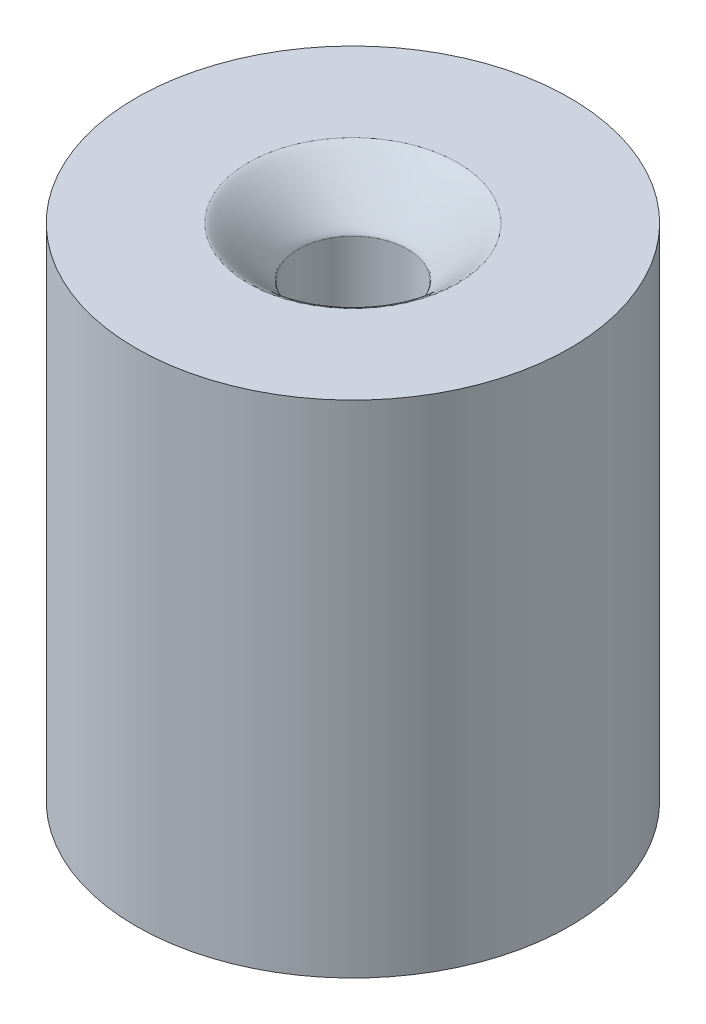
ISO-10303-21;
HEADER;
FILE_DESCRIPTION(('STEP AP214'),'2;1');
FILE_NAME('part.step','',(''),(''),'','','');
FILE_SCHEMA(('AUTOMOTIVE_DESIGN { 1 0 10303 214 1 1 1 1 }'));
ENDSEC;
DATA;
#1=APPLICATION_CONTEXT('core data for automotive mechanical design processes');
#2=APPLICATION_PROTOCOL_DEFINITION('international standard','automotive_design',2000,#1);
#3=PRODUCT_CONTEXT('',#1,'mechanical');
#4=PRODUCT('Part','Part','',(#3));
#5=PRODUCT_RELATED_PRODUCT_CATEGORY('part','',(#4));
#6=PRODUCT_DEFINITION_FORMATION('','',#4);
#7=PRODUCT_DEFINITION_CONTEXT('part definition',#1,'design');
#8=PRODUCT_DEFINITION('design','',#6,#7);
#9=PRODUCT_DEFINITION_SHAPE('','',#8);
#10=(LENGTH_UNIT() NAMED_UNIT(*) SI_UNIT(.MILLI.,.METRE.));
#11=(NAMED_UNIT(*) PLANE_ANGLE_UNIT() SI_UNIT($,.RADIAN.));
#12=(NAMED_UNIT(*) SI_UNIT($,.STERADIAN.) SOLID_ANGLE_UNIT());
#13=UNCERTAINTY_MEASURE_WITH_UNIT(LENGTH_MEASURE(1.E-05),#10,'distance_accuracy_value','');
#14=(GEOMETRIC_REPRESENTATION_CONTEXT(3) GLOBAL_UNCERTAINTY_ASSIGNED_CONTEXT((#13)) GLOBAL_UNIT_ASSIGNED_CONTEXT((#10,
#11,#12)) REPRESENTATION_CONTEXT('',''));
#15=CARTESIAN_POINT('',(0.,0.,0.));
#16=DIRECTION('',(0.,0.,1.));
#17=DIRECTION('',(1.,0.,0.));
#18=AXIS2_PLACEMENT_3D('',#15,#16,#17);
#19=CARTESIAN_POINT('',(0.,15.,0.));
#20=DIRECTION('',(0.,-1.,0.));
#21=DIRECTION('',(0.,0.,-1.));
#22=AXIS2_PLACEMENT_3D('',#19,#20,#21);
#23=CYLINDRICAL_SURFACE('',#22,6.5);
#24=CARTESIAN_POINT('',(0.,15.,0.));
#25=DIRECTION('',(0.,1.,0.));
#26=DIRECTION('',(0.,0.,1.));
#27=AXIS2_PLACEMENT_3D('',#24,#25,#26);
#28=CIRCLE('',#27,6.5);
#29=CARTESIAN_POINT('',(0.,15.,6.5));
#30=VERTEX_POINT('',#29);
#31=EDGE_CURVE('E62',#30,#30,#28,.T.);
#32=ORIENTED_EDGE('',*,*,#31,.F.);
#33=EDGE_LOOP('',(#32));
#34=FACE_BOUND('',#33,.T.);
#35=CARTESIAN_POINT('',(0.,0.,0.));
#36=DIRECTION('',(0.,1.,0.));
#37=DIRECTION('',(0.,0.,1.));
#38=AXIS2_PLACEMENT_3D('',#35,#36,#37);
#39=CIRCLE('',#38,6.5);
#40=CARTESIAN_POINT('',(0.,0.,6.5));
#41=VERTEX_POINT('',#40);
#42=EDGE_CURVE('E68',#41,#41,#39,.T.);
#43=ORIENTED_EDGE('',*,*,#42,.T.);
#44=EDGE_LOOP('',(#43));
#45=FACE_BOUND('',#44,.T.);
#46=ADVANCED_FACE('F42',(#34,#45),#23,.T.);
#47=CARTESIAN_POINT('',(0.,15.,0.));
#48=DIRECTION('',(0.,1.,0.));
#49=DIRECTION('',(0.,0.,1.));
#50=AXIS2_PLACEMENT_3D('',#47,#48,#49);
#51=PLANE('',#50);
#52=CARTESIAN_POINT('',(0.,15.,3.1383));
#53=CARTESIAN_POINT('',(0.410802502413288,15.,3.1383));
#54=CARTESIAN_POINT('',(0.821443391907262,15.,3.05661844852785));
#55=CARTESIAN_POINT('',(1.58050743967546,15.,2.74220382523249));
#56=CARTESIAN_POINT('',(1.92863197621287,15.,2.50959444658261));
#57=CARTESIAN_POINT('',(2.50959444658261,15.,1.92863197621287));
#58=CARTESIAN_POINT('',(2.74220382523247,15.,1.58050743967544));
#59=CARTESIAN_POINT('',(3.05661844852788,15.,0.821443391907283));
#60=CARTESIAN_POINT('',(3.1383,15.,0.410802502413305));
#61=CARTESIAN_POINT('',(3.1383,15.,-0.410802502413305));
#62=CARTESIAN_POINT('',(3.05661844852788,15.,-0.82144339190733));
#63=CARTESIAN_POINT('',(2.74220382523246,15.,-1.58050743967539));
#64=CARTESIAN_POINT('',(2.50959444658259,15.,-1.9286319762129));
#65=CARTESIAN_POINT('',(1.92863197621289,15.,-2.50959444658259));
#66=CARTESIAN_POINT('',(1.58050743967545,15.,-2.74220382523248));
#67=CARTESIAN_POINT('',(0.821443391907286,15.,-3.05661844852785));
#68=CARTESIAN_POINT('',(0.410802502413305,15.,-3.1383));
#69=CARTESIAN_POINT('',(-0.410802502413305,15.,-3.1383));
#70=CARTESIAN_POINT('',(-0.821443391907278,15.,-3.05661844852786));
#71=CARTESIAN_POINT('',(-1.58050743967544,15.,-2.74220382523249));
#72=CARTESIAN_POINT('',(-1.9286319762129,15.,-2.50959444658259));
#73=CARTESIAN_POINT('',(-2.50959444658259,15.,-1.9286319762129));
#74=CARTESIAN_POINT('',(-2.74220382523253,15.,-1.58050743967548));
#75=CARTESIAN_POINT('',(-3.05661844852781,15.,-0.821443391907247));
#76=CARTESIAN_POINT('',(-3.1383,15.,-0.4108025024133));
#77=CARTESIAN_POINT('',(-3.1383,15.,0.41080250241331));
#78=CARTESIAN_POINT('',(-3.05661844852781,15.,0.821443391907283));
#79=CARTESIAN_POINT('',(-2.74220382523254,15.,1.58050743967543));
#80=CARTESIAN_POINT('',(-2.50959444658255,15.,1.92863197621284));
#81=CARTESIAN_POINT('',(-1.92863197621294,15.,2.50959444658263));
#82=CARTESIAN_POINT('',(-1.58050743967548,15.,2.74220382523244));
#83=CARTESIAN_POINT('',(-0.821443391907247,15.,3.0566184485279));
#84=CARTESIAN_POINT('',(-0.410802502413289,15.,3.1383));
#85=CARTESIAN_POINT('',(0.,15.,3.1383));
#86=(BOUNDED_CURVE() B_SPLINE_CURVE(3,(#52,#53,#54,#55,#56,#57,#58,#59,#60,#61,#62,#63,#64,#65,
#66,#67,#68,#69,#70,#71,#72,#73,#74,#75,#76,#77,#78,#79,#80,#81,#82,#83,#84,#85),.UNSPECIFIED.,
.T.,.F.) B_SPLINE_CURVE_WITH_KNOTS((4,2,2,2,2,2,2,2,2,2,2,2,2,2,2,2,4),(0.,0.392699081698724,
0.785398163397448,1.17809724509617,1.5707963267949,1.96349540849362,2.35619449019234,
2.74889357189107,3.14159265358979,3.53429173528852,3.92699081698724,4.31968989868597,
4.71238898038469,5.10508806208341,5.49778714378214,5.89048622548086,6.28318530717959),
.UNSPECIFIED.) CURVE() GEOMETRIC_REPRESENTATION_ITEM() RATIONAL_B_SPLINE_CURVE((1.,1.,1.,1.,1.,
1.,1.,1.,1.,1.,1.,1.,1.,1.,1.,1.,1.,1.,1.,1.,1.,1.,1.,1.,1.,1.,1.,1.,1.,1.,1.,1.,1.,1.)) REPRESENTATION_ITEM(''));
#87=CARTESIAN_POINT('',(0.,15.,3.1383));
#88=VERTEX_POINT('',#87);
#89=EDGE_CURVE('E11',#88,#88,#86,.F.);
#90=ORIENTED_EDGE('',*,*,#89,.T.);
#91=EDGE_LOOP('',(#90));
#92=FACE_BOUND('',#91,.T.);
#93=ORIENTED_EDGE('',*,*,#31,.T.);
#94=EDGE_LOOP('',(#93));
#95=FACE_BOUND('',#94,.T.);
#96=ADVANCED_FACE('F92',(#92,#95),#51,.T.);
#97=CARTESIAN_POINT('',(0.,0.,0.));
#98=DIRECTION('',(0.,1.,0.));
#99=DIRECTION('',(0.,0.,1.));
#100=AXIS2_PLACEMENT_3D('',#97,#98,#99);
#101=PLANE('',#100);
#102=CARTESIAN_POINT('',(0.,0.,0.));
#103=DIRECTION('',(0.,1.,0.));
#104=DIRECTION('',(0.,0.,1.));
#105=AXIS2_PLACEMENT_3D('',#102,#103,#104);
#106=CIRCLE('',#105,1.6383);
#107=CARTESIAN_POINT('',(0.,0.,1.6383));
#108=VERTEX_POINT('',#107);
#109=EDGE_CURVE('E74',#108,#108,#106,.T.);
#110=ORIENTED_EDGE('',*,*,#109,.T.);
#111=EDGE_LOOP('',(#110));
#112=FACE_BOUND('',#111,.T.);
#113=ORIENTED_EDGE('',*,*,#42,.F.);
#114=EDGE_LOOP('',(#113));
#115=FACE_BOUND('',#114,.T.);
#116=ADVANCED_FACE('F91',(#112,#115),#101,.F.);
#117=CARTESIAN_POINT('',(0.,0.,0.));
#118=DIRECTION('',(0.,1.,0.));
#119=DIRECTION('',(0.,0.,1.));
#120=AXIS2_PLACEMENT_3D('',#117,#118,#119);
#121=CYLINDRICAL_SURFACE('',#120,1.6383);
#122=CARTESIAN_POINT('',(0.,13.5,1.6383));
#123=CARTESIAN_POINT('',(-0.214452964886624,13.5,1.6383));
#124=CARTESIAN_POINT('',(-0.428821562298608,13.5,1.59565943479693));
#125=CARTESIAN_POINT('',(-0.825078972188849,13.5,1.43152424142955));
#126=CARTESIAN_POINT('',(-1.00681189390103,13.5,1.31009418533481));
#127=CARTESIAN_POINT('',(-1.31009418533482,13.5,1.00681189390102));
#128=CARTESIAN_POINT('',(-1.43152424142956,13.5,0.825078972188829));
#129=CARTESIAN_POINT('',(-1.59565943479692,13.5,0.428821562298619));
#130=CARTESIAN_POINT('',(-1.6383,13.5,0.214452964886635));
#131=CARTESIAN_POINT('',(-1.6383,13.5,-0.21445296488663));
#132=CARTESIAN_POINT('',(-1.59565943479693,13.5,-0.428821562298608));
#133=CARTESIAN_POINT('',(-1.43152424142955,13.5,-0.825078972188849));
#134=CARTESIAN_POINT('',(-1.3100941853348,13.5,-1.00681189390104));
#135=CARTESIAN_POINT('',(-1.00681189390104,13.5,-1.3100941853348));
#136=CARTESIAN_POINT('',(-0.825078972188832,13.5,-1.43152424142956));
#137=CARTESIAN_POINT('',(-0.428821562298617,13.5,-1.59565943479692));
#138=CARTESIAN_POINT('',(-0.214452964886632,13.5,-1.6383));
#139=CARTESIAN_POINT('',(0.214452964886632,13.5,-1.6383));
#140=CARTESIAN_POINT('',(0.428821562298594,13.5,-1.59565943479693));
#141=CARTESIAN_POINT('',(0.825078972188864,13.5,-1.43152424142955));
#142=CARTESIAN_POINT('',(1.00681189390104,13.5,-1.3100941853348));
#143=CARTESIAN_POINT('',(1.3100941853348,13.5,-1.00681189390104));
#144=CARTESIAN_POINT('',(1.43152424142957,13.5,-0.825078972188802));
#145=CARTESIAN_POINT('',(1.59565943479691,13.5,-0.428821562298653));
#146=CARTESIAN_POINT('',(1.6383,13.5,-0.214452964886632));
#147=CARTESIAN_POINT('',(1.6383,13.5,0.214452964886632));
#148=CARTESIAN_POINT('',(1.59565943479693,13.5,0.428821562298601));
#149=CARTESIAN_POINT('',(1.43152424142955,13.5,0.825078972188851));
#150=CARTESIAN_POINT('',(1.31009418533482,13.5,1.00681189390102));
#151=CARTESIAN_POINT('',(1.00681189390102,13.5,1.31009418533482));
#152=CARTESIAN_POINT('',(0.825078972188842,13.5,1.43152424142956));
#153=CARTESIAN_POINT('',(0.428821562298611,13.5,1.59565943479693));
#154=CARTESIAN_POINT('',(0.214452964886623,13.5,1.6383));
#155=CARTESIAN_POINT('',(0.,13.5,1.6383));
#156=(BOUNDED_CURVE() B_SPLINE_CURVE(3,(#122,#123,#124,#125,#126,#127,#128,#129,#130,#131,#132,
#133,#134,#135,#136,#137,#138,#139,#140,#141,#142,#143,#144,#145,#146,#147,#148,#149,#150,#151,
#152,#153,#154,#155),.UNSPECIFIED.,.T.,.F.) B_SPLINE_CURVE_WITH_KNOTS((4,2,2,2,2,2,2,2,2,2,2,2,
2,2,2,2,4),(0.,0.392699081698725,0.785398163397448,1.17809724509617,1.5707963267949,
1.96349540849362,2.35619449019234,2.74889357189107,3.14159265358979,3.53429173528852,
3.92699081698724,4.31968989868597,4.71238898038469,5.10508806208341,5.49778714378214,
5.89048622548086,6.28318530717959),
.UNSPECIFIED.) CURVE() GEOMETRIC_REPRESENTATION_ITEM() RATIONAL_B_SPLINE_CURVE((1.,1.,1.,1.,1.,
1.,1.,1.,1.,1.,1.,1.,1.,1.,1.,1.,1.,1.,1.,1.,1.,1.,1.,1.,1.,1.,1.,1.,1.,1.,1.,1.,1.,1.)) REPRESENTATION_ITEM(''));
#157=CARTESIAN_POINT('',(0.,13.5,1.6383));
#158=VERTEX_POINT('',#157);
#159=EDGE_CURVE('E56',#158,#158,#156,.F.);
#160=ORIENTED_EDGE('',*,*,#159,.T.);
#161=EDGE_LOOP('',(#160));
#162=FACE_BOUND('',#161,.T.);
#163=ORIENTED_EDGE('',*,*,#109,.F.);
#164=EDGE_LOOP('',(#163));
#165=FACE_BOUND('',#164,.T.);
#166=ADVANCED_FACE('F82',(#162,#165),#121,.F.);
#167=CARTESIAN_POINT('',(0.,13.5,1.6383));
#168=CARTESIAN_POINT('',(0.214452964886623,13.5,1.6383));
#169=CARTESIAN_POINT('',(0.428821562298611,13.5,1.59565943479693));
#170=CARTESIAN_POINT('',(0.825078972188842,13.5,1.43152424142956));
#171=CARTESIAN_POINT('',(1.00681189390102,13.5,1.31009418533482));
#172=CARTESIAN_POINT('',(1.31009418533482,13.5,1.00681189390102));
#173=CARTESIAN_POINT('',(1.43152424142955,13.5,0.825078972188851));
#174=CARTESIAN_POINT('',(1.59565943479693,13.5,0.428821562298601));
#175=CARTESIAN_POINT('',(1.6383,13.5,0.214452964886632));
#176=CARTESIAN_POINT('',(1.6383,13.5,-0.214452964886632));
#177=CARTESIAN_POINT('',(1.59565943479691,13.5,-0.428821562298653));
#178=CARTESIAN_POINT('',(1.43152424142957,13.5,-0.825078972188802));
#179=CARTESIAN_POINT('',(1.3100941853348,13.5,-1.00681189390104));
#180=CARTESIAN_POINT('',(1.00681189390104,13.5,-1.3100941853348));
#181=CARTESIAN_POINT('',(0.825078972188864,13.5,-1.43152424142955));
#182=CARTESIAN_POINT('',(0.428821562298594,13.5,-1.59565943479693));
#183=CARTESIAN_POINT('',(0.214452964886632,13.5,-1.6383));
#184=CARTESIAN_POINT('',(-0.214452964886632,13.5,-1.6383));
#185=CARTESIAN_POINT('',(-0.428821562298617,13.5,-1.59565943479692));
#186=CARTESIAN_POINT('',(-0.825078972188832,13.5,-1.43152424142956));
#187=CARTESIAN_POINT('',(-1.00681189390104,13.5,-1.3100941853348));
#188=CARTESIAN_POINT('',(-1.3100941853348,13.5,-1.00681189390104));
#189=CARTESIAN_POINT('',(-1.43152424142955,13.5,-0.825078972188849));
#190=CARTESIAN_POINT('',(-1.59565943479693,13.5,-0.428821562298608));
#191=CARTESIAN_POINT('',(-1.6383,13.5,-0.21445296488663));
#192=CARTESIAN_POINT('',(-1.6383,13.5,0.214452964886635));
#193=CARTESIAN_POINT('',(-1.59565943479692,13.5,0.428821562298619));
#194=CARTESIAN_POINT('',(-1.43152424142956,13.5,0.825078972188829));
#195=CARTESIAN_POINT('',(-1.31009418533482,13.5,1.00681189390102));
#196=CARTESIAN_POINT('',(-1.00681189390103,13.5,1.31009418533481));
#197=CARTESIAN_POINT('',(-0.825078972188849,13.5,1.43152424142955));
#198=CARTESIAN_POINT('',(-0.428821562298608,13.5,1.59565943479693));
#199=CARTESIAN_POINT('',(-0.214452964886624,13.5,1.6383));
#200=CARTESIAN_POINT('',(0.,13.5,1.6383));
#201=CARTESIAN_POINT('',(0.,15.,1.6383));
#202=CARTESIAN_POINT('',(0.214452964886623,15.,1.6383));
#203=CARTESIAN_POINT('',(0.428821562298567,15.,1.59565943479687));
#204=CARTESIAN_POINT('',(0.825078972188887,15.,1.43152424142961));
#205=CARTESIAN_POINT('',(1.00681189390107,15.,1.31009418533486));
#206=CARTESIAN_POINT('',(1.31009418533478,15.,1.00681189390098));
#207=CARTESIAN_POINT('',(1.43152424142946,15.,0.825078972188854));
#208=CARTESIAN_POINT('',(1.59565943479702,15.,0.428821562298598));
#209=CARTESIAN_POINT('',(1.6383,15.,0.214452964886632));
#210=CARTESIAN_POINT('',(1.6383,15.,-0.214452964886632));
#211=CARTESIAN_POINT('',(1.59565943479684,15.,-0.428821562298622));
#212=CARTESIAN_POINT('',(1.43152424142964,15.,-0.825078972188833));
#213=CARTESIAN_POINT('',(1.3100941853348,15.,-1.00681189390104));
#214=CARTESIAN_POINT('',(1.00681189390104,15.,-1.3100941853348));
#215=CARTESIAN_POINT('',(0.825078972188897,15.,-1.43152424142956));
#216=CARTESIAN_POINT('',(0.428821562298561,15.,-1.59565943479692));
#217=CARTESIAN_POINT('',(0.214452964886632,15.,-1.6383));
#218=CARTESIAN_POINT('',(-0.214452964886632,15.,-1.6383));
#219=CARTESIAN_POINT('',(-0.428821562298579,15.,-1.59565943479683));
#220=CARTESIAN_POINT('',(-0.82507897218887,15.,-1.43152424142965));
#221=CARTESIAN_POINT('',(-1.00681189390104,15.,-1.3100941853348));
#222=CARTESIAN_POINT('',(-1.3100941853348,15.,-1.00681189390104));
#223=CARTESIAN_POINT('',(-1.43152424142954,15.,-0.825078972188861));
#224=CARTESIAN_POINT('',(-1.59565943479694,15.,-0.428821562298597));
#225=CARTESIAN_POINT('',(-1.6383,15.,-0.21445296488663));
#226=CARTESIAN_POINT('',(-1.6383,15.,0.214452964886635));
#227=CARTESIAN_POINT('',(-1.59565943479686,15.,0.428821562298592));
#228=CARTESIAN_POINT('',(-1.43152424142963,15.,0.825078972188856));
#229=CARTESIAN_POINT('',(-1.31009418533479,15.,1.006811893901));
#230=CARTESIAN_POINT('',(-1.00681189390105,15.,1.31009418533483));
#231=CARTESIAN_POINT('',(-0.825078972188861,15.,1.43152424142958));
#232=CARTESIAN_POINT('',(-0.428821562298597,15.,1.5956594347969));
#233=CARTESIAN_POINT('',(-0.214452964886623,15.,1.6383));
#234=CARTESIAN_POINT('',(0.,15.,1.6383));
#235=CARTESIAN_POINT('',(0.,15.,3.1383));
#236=CARTESIAN_POINT('',(0.410802502413288,15.,3.1383));
#237=CARTESIAN_POINT('',(0.821443391907262,15.,3.05661844852785));
#238=CARTESIAN_POINT('',(1.58050743967546,15.,2.74220382523249));
#239=CARTESIAN_POINT('',(1.92863197621287,15.,2.50959444658261));
#240=CARTESIAN_POINT('',(2.50959444658261,15.,1.92863197621287));
#241=CARTESIAN_POINT('',(2.74220382523247,15.,1.58050743967544));
#242=CARTESIAN_POINT('',(3.05661844852788,15.,0.821443391907283));
#243=CARTESIAN_POINT('',(3.1383,15.,0.410802502413305));
#244=CARTESIAN_POINT('',(3.1383,15.,-0.410802502413305));
#245=CARTESIAN_POINT('',(3.05661844852788,15.,-0.82144339190733));
#246=CARTESIAN_POINT('',(2.74220382523246,15.,-1.58050743967539));
#247=CARTESIAN_POINT('',(2.50959444658259,15.,-1.9286319762129));
#248=CARTESIAN_POINT('',(1.92863197621289,15.,-2.50959444658259));
#249=CARTESIAN_POINT('',(1.58050743967545,15.,-2.74220382523248));
#250=CARTESIAN_POINT('',(0.821443391907286,15.,-3.05661844852785));
#251=CARTESIAN_POINT('',(0.410802502413305,15.,-3.1383));
#252=CARTESIAN_POINT('',(-0.410802502413305,15.,-3.1383));
#253=CARTESIAN_POINT('',(-0.821443391907278,15.,-3.05661844852786));
#254=CARTESIAN_POINT('',(-1.58050743967544,15.,-2.74220382523249));
#255=CARTESIAN_POINT('',(-1.9286319762129,15.,-2.50959444658259));
#256=CARTESIAN_POINT('',(-2.50959444658259,15.,-1.9286319762129));
#257=CARTESIAN_POINT('',(-2.74220382523253,15.,-1.58050743967548));
#258=CARTESIAN_POINT('',(-3.05661844852781,15.,-0.821443391907247));
#259=CARTESIAN_POINT('',(-3.1383,15.,-0.4108025024133));
#260=CARTESIAN_POINT('',(-3.1383,15.,0.41080250241331));
#261=CARTESIAN_POINT('',(-3.05661844852781,15.,0.821443391907283));
#262=CARTESIAN_POINT('',(-2.74220382523254,15.,1.58050743967543));
#263=CARTESIAN_POINT('',(-2.50959444658255,15.,1.92863197621284));
#264=CARTESIAN_POINT('',(-1.92863197621294,15.,2.50959444658263));
#265=CARTESIAN_POINT('',(-1.58050743967548,15.,2.74220382523244));
#266=CARTESIAN_POINT('',(-0.821443391907247,15.,3.0566184485279));
#267=CARTESIAN_POINT('',(-0.410802502413289,15.,3.1383));
#268=CARTESIAN_POINT('',(0.,15.,3.1383));
#269=(BOUNDED_SURFACE() B_SPLINE_SURFACE(2,3,((#167,#168,#169,#170,#171,#172,#173,#174,#175,
#176,#177,#178,#179,#180,#181,#182,#183,#184,#185,#186,#187,#188,#189,#190,#191,#192,#193,#194,
#195,#196,#197,#198,#199,#200),(#201,#202,#203,#204,#205,#206,#207,#208,#209,#210,#211,#212,
#213,#214,#215,#216,#217,#218,#219,#220,#221,#222,#223,#224,#225,#226,#227,#228,#229,#230,#231,
#232,#233,#234),(#235,#236,#237,#238,#239,#240,#241,#242,#243,#244,#245,#246,#247,#248,#249,
#250,#251,#252,#253,#254,#255,#256,#257,#258,#259,#260,#261,#262,#263,#264,#265,#266,#267,
#268)),.UNSPECIFIED.,.F.,.T.,.F.) B_SPLINE_SURFACE_WITH_KNOTS((3,3),(4,2,2,2,2,2,2,2,2,2,2,2,2,
2,2,2,4),(0.,1.),(0.,0.392699081698724,0.785398163397448,1.17809724509617,1.5707963267949,
1.96349540849362,2.35619449019234,2.74889357189107,3.14159265358979,3.53429173528852,
3.92699081698724,4.31968989868597,4.71238898038469,5.10508806208341,5.49778714378214,
5.89048622548086,6.28318530717959),
.UNSPECIFIED.) GEOMETRIC_REPRESENTATION_ITEM() RATIONAL_B_SPLINE_SURFACE(((1.,1.,1.,1.,1.,1.,1.,
1.,1.,1.,1.,1.,1.,1.,1.,1.,1.,1.,1.,1.,1.,1.,1.,1.,1.,1.,1.,1.,1.,1.,1.,1.,1.,1.),
(0.106066017177982,0.106066017177982,0.106066017177982,0.106066017177982,0.106066017177982,
0.106066017177982,0.106066017177982,0.106066017177982,0.106066017177982,0.106066017177982,
0.106066017177982,0.106066017177982,0.106066017177982,0.106066017177982,0.106066017177982,
0.106066017177982,0.106066017177982,0.106066017177982,0.106066017177982,0.106066017177982,
0.106066017177982,0.106066017177982,0.106066017177982,0.106066017177982,0.106066017177982,
0.106066017177982,0.106066017177982,0.106066017177982,0.106066017177982,0.106066017177982,
0.106066017177982,0.106066017177982,0.106066017177982,0.106066017177982),(1.,1.,1.,1.,1.,1.,1.,
1.,1.,1.,1.,1.,1.,1.,1.,1.,1.,1.,1.,1.,1.,1.,1.,1.,1.,1.,1.,1.,1.,1.,1.,1.,1.,1.))) REPRESENTATION_ITEM('') SURFACE());
#270=ORIENTED_EDGE('',*,*,#89,.F.);
#271=EDGE_LOOP('',(#270));
#272=FACE_BOUND('',#271,.T.);
#273=ORIENTED_EDGE('',*,*,#159,.F.);
#274=EDGE_LOOP('',(#273));
#275=FACE_BOUND('',#274,.T.);
#276=ADVANCED_FACE('F45',(#272,#275),#269,.T.);
#277=CLOSED_SHELL('',(#46,#96,#116,#166,#276));
#278=MANIFOLD_SOLID_BREP('B2',#277);
#279=ADVANCED_BREP_SHAPE_REPRESENTATION('',(#18,#278),#14);
#280=SHAPE_DEFINITION_REPRESENTATION(#9,#279);
ENDSEC;
END-ISO-10303-21;
